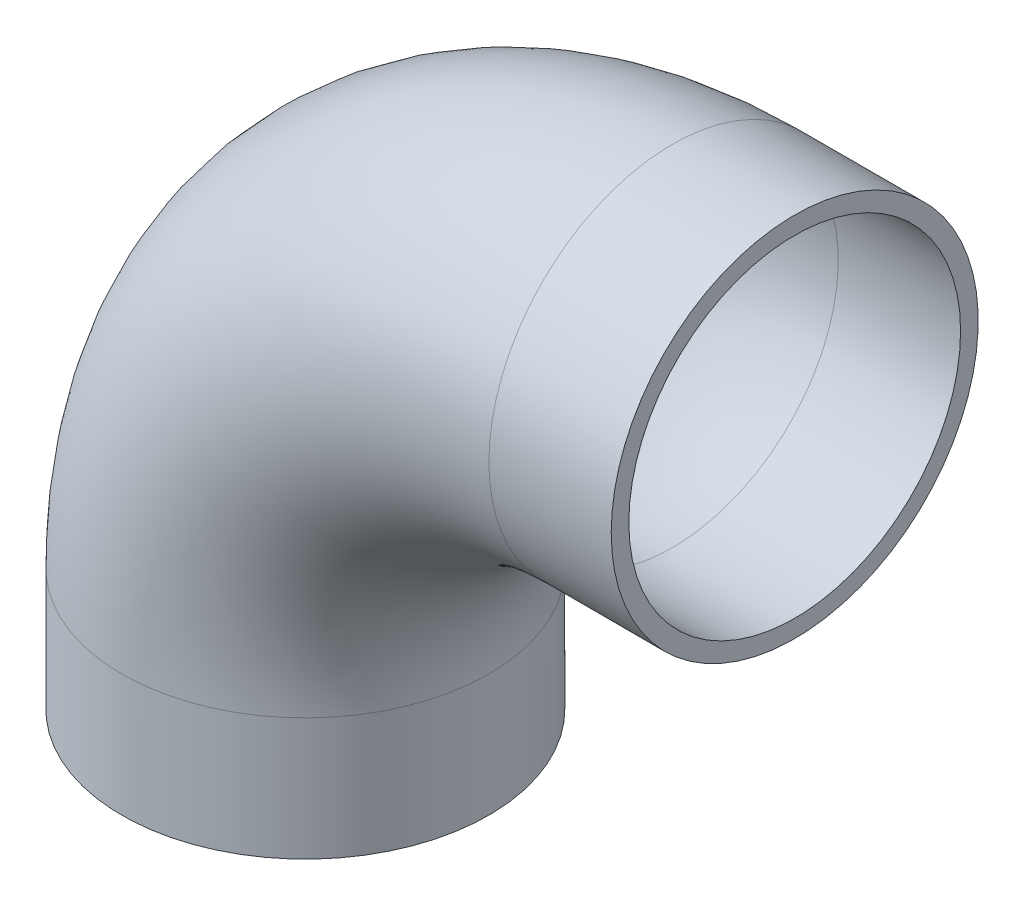
ISO-10303-21;
HEADER;
FILE_DESCRIPTION(('STEP AP214'),'2;1');
FILE_NAME('part.step','',(''),(''),'','','');
FILE_SCHEMA(('AUTOMOTIVE_DESIGN { 1 0 10303 214 1 1 1 1 }'));
ENDSEC;
DATA;
#1=APPLICATION_CONTEXT('core data for automotive mechanical design processes');
#2=APPLICATION_PROTOCOL_DEFINITION('international standard','automotive_design',2000,#1);
#3=PRODUCT_CONTEXT('',#1,'mechanical');
#4=PRODUCT('Part','Part','',(#3));
#5=PRODUCT_RELATED_PRODUCT_CATEGORY('part','',(#4));
#6=PRODUCT_DEFINITION_FORMATION('','',#4);
#7=PRODUCT_DEFINITION_CONTEXT('part definition',#1,'design');
#8=PRODUCT_DEFINITION('design','',#6,#7);
#9=PRODUCT_DEFINITION_SHAPE('','',#8);
#10=(LENGTH_UNIT() NAMED_UNIT(*) SI_UNIT(.MILLI.,.METRE.));
#11=(NAMED_UNIT(*) PLANE_ANGLE_UNIT() SI_UNIT($,.RADIAN.));
#12=(NAMED_UNIT(*) SI_UNIT($,.STERADIAN.) SOLID_ANGLE_UNIT());
#13=UNCERTAINTY_MEASURE_WITH_UNIT(LENGTH_MEASURE(1.E-05),#10,'distance_accuracy_value','');
#14=(GEOMETRIC_REPRESENTATION_CONTEXT(3) GLOBAL_UNCERTAINTY_ASSIGNED_CONTEXT((#13)) GLOBAL_UNIT_ASSIGNED_CONTEXT((#10,
#11,#12)) REPRESENTATION_CONTEXT('',''));
#15=CARTESIAN_POINT('',(0.,0.,0.));
#16=DIRECTION('',(0.,0.,1.));
#17=DIRECTION('',(1.,0.,0.));
#18=AXIS2_PLACEMENT_3D('',#15,#16,#17);
#19=CARTESIAN_POINT('',(75.,25.,0.));
#20=DIRECTION('',(0.,0.,1.));
#21=DIRECTION('',(1.,0.,0.));
#22=AXIS2_PLACEMENT_3D('',#19,#20,#21);
#23=TOROIDAL_SURFACE('',#22,75.,33.9);
#24=CARTESIAN_POINT('',(75.,100.,0.));
#25=DIRECTION('',(-1.,0.,0.));
#26=DIRECTION('',(0.,1.,0.));
#27=AXIS2_PLACEMENT_3D('',#24,#25,#26);
#28=CIRCLE('',#27,33.9);
#29=CARTESIAN_POINT('',(75.,133.9,0.));
#30=VERTEX_POINT('',#29);
#31=EDGE_CURVE('E33',#30,#30,#28,.T.);
#32=ORIENTED_EDGE('',*,*,#31,.F.);
#33=EDGE_LOOP('',(#32));
#34=FACE_BOUND('',#33,.T.);
#35=CARTESIAN_POINT('',(0.,25.,0.));
#36=DIRECTION('',(0.,-1.,0.));
#37=DIRECTION('',(-1.,0.,0.));
#38=AXIS2_PLACEMENT_3D('',#35,#36,#37);
#39=CIRCLE('',#38,33.9);
#40=CARTESIAN_POINT('',(-33.9,25.,0.));
#41=VERTEX_POINT('',#40);
#42=EDGE_CURVE('E31',#41,#41,#39,.F.);
#43=ORIENTED_EDGE('',*,*,#42,.F.);
#44=EDGE_LOOP('',(#43));
#45=FACE_BOUND('',#44,.T.);
#46=ADVANCED_FACE('F13',(#34,#45),#23,.F.);
#47=CARTESIAN_POINT('',(100.,100.,0.));
#48=DIRECTION('',(-1.,0.,0.));
#49=DIRECTION('',(0.,0.,1.));
#50=AXIS2_PLACEMENT_3D('',#47,#48,#49);
#51=CYLINDRICAL_SURFACE('',#50,33.9);
#52=CARTESIAN_POINT('',(100.,100.,0.));
#53=DIRECTION('',(-1.,0.,0.));
#54=DIRECTION('',(0.,0.,1.));
#55=AXIS2_PLACEMENT_3D('',#52,#53,#54);
#56=CIRCLE('',#55,33.9);
#57=CARTESIAN_POINT('',(100.,100.,33.9));
#58=VERTEX_POINT('',#57);
#59=EDGE_CURVE('E17',#58,#58,#56,.T.);
#60=ORIENTED_EDGE('',*,*,#59,.F.);
#61=EDGE_LOOP('',(#60));
#62=FACE_BOUND('',#61,.T.);
#63=ORIENTED_EDGE('',*,*,#31,.T.);
#64=EDGE_LOOP('',(#63));
#65=FACE_BOUND('',#64,.T.);
#66=ADVANCED_FACE('F52',(#62,#65),#51,.F.);
#67=CARTESIAN_POINT('',(0.,25.,0.));
#68=DIRECTION('',(0.,-1.,0.));
#69=DIRECTION('',(0.,0.,-1.));
#70=AXIS2_PLACEMENT_3D('',#67,#68,#69);
#71=CYLINDRICAL_SURFACE('',#70,33.9);
#72=ORIENTED_EDGE('',*,*,#42,.T.);
#73=EDGE_LOOP('',(#72));
#74=FACE_BOUND('',#73,.T.);
#75=CARTESIAN_POINT('',(0.,0.,0.));
#76=DIRECTION('',(0.,-1.,0.));
#77=DIRECTION('',(0.,0.,-1.));
#78=AXIS2_PLACEMENT_3D('',#75,#76,#77);
#79=CIRCLE('',#78,33.9);
#80=CARTESIAN_POINT('',(0.,0.,-33.9));
#81=VERTEX_POINT('',#80);
#82=EDGE_CURVE('E42',#81,#81,#79,.F.);
#83=ORIENTED_EDGE('',*,*,#82,.F.);
#84=EDGE_LOOP('',(#83));
#85=FACE_BOUND('',#84,.T.);
#86=ADVANCED_FACE('F55',(#74,#85),#71,.F.);
#87=CARTESIAN_POINT('',(100.,137.5,37.9500021082342));
#88=DIRECTION('',(1.,0.,0.));
#89=DIRECTION('',(0.,-1.,0.));
#90=AXIS2_PLACEMENT_3D('',#87,#88,#89);
#91=PLANE('',#90);
#92=ORIENTED_EDGE('',*,*,#59,.T.);
#93=EDGE_LOOP('',(#92));
#94=FACE_BOUND('',#93,.T.);
#95=CARTESIAN_POINT('',(100.,100.,0.));
#96=DIRECTION('',(-1.,0.,0.));
#97=DIRECTION('',(0.,0.,1.));
#98=AXIS2_PLACEMENT_3D('',#95,#96,#97);
#99=CIRCLE('',#98,37.5);
#100=CARTESIAN_POINT('',(100.,100.,37.5));
#101=VERTEX_POINT('',#100);
#102=EDGE_CURVE('E40',#101,#101,#99,.T.);
#103=ORIENTED_EDGE('',*,*,#102,.F.);
#104=EDGE_LOOP('',(#103));
#105=FACE_BOUND('',#104,.T.);
#106=ADVANCED_FACE('F49',(#94,#105),#91,.T.);
#107=CARTESIAN_POINT('',(37.5,0.,37.9500021083576));
#108=DIRECTION('',(0.,-1.,0.));
#109=DIRECTION('',(-1.,0.,0.));
#110=AXIS2_PLACEMENT_3D('',#107,#108,#109);
#111=PLANE('',#110);
#112=ORIENTED_EDGE('',*,*,#82,.T.);
#113=EDGE_LOOP('',(#112));
#114=FACE_BOUND('',#113,.T.);
#115=CARTESIAN_POINT('',(0.,0.,0.));
#116=DIRECTION('',(0.,-1.,0.));
#117=DIRECTION('',(0.,0.,-1.));
#118=AXIS2_PLACEMENT_3D('',#115,#116,#117);
#119=CIRCLE('',#118,37.5);
#120=CARTESIAN_POINT('',(0.,0.,-37.5));
#121=VERTEX_POINT('',#120);
#122=EDGE_CURVE('E26',#121,#121,#119,.F.);
#123=ORIENTED_EDGE('',*,*,#122,.F.);
#124=EDGE_LOOP('',(#123));
#125=FACE_BOUND('',#124,.T.);
#126=ADVANCED_FACE('F69',(#114,#125),#111,.T.);
#127=CARTESIAN_POINT('',(75.,100.,0.));
#128=DIRECTION('',(-1.,0.,0.));
#129=DIRECTION('',(0.,0.,1.));
#130=AXIS2_PLACEMENT_3D('',#127,#128,#129);
#131=CYLINDRICAL_SURFACE('',#130,37.5);
#132=ORIENTED_EDGE('',*,*,#102,.T.);
#133=EDGE_LOOP('',(#132));
#134=FACE_BOUND('',#133,.T.);
#135=CARTESIAN_POINT('',(75.,100.,0.));
#136=DIRECTION('',(-1.,0.,0.));
#137=DIRECTION('',(0.,-1.,0.));
#138=AXIS2_PLACEMENT_3D('',#135,#136,#137);
#139=CIRCLE('',#138,37.5);
#140=CARTESIAN_POINT('',(75.,62.5,0.));
#141=VERTEX_POINT('',#140);
#142=EDGE_CURVE('E21',#141,#141,#139,.T.);
#143=ORIENTED_EDGE('',*,*,#142,.F.);
#144=EDGE_LOOP('',(#143));
#145=FACE_BOUND('',#144,.T.);
#146=ADVANCED_FACE('F79',(#134,#145),#131,.T.);
#147=CARTESIAN_POINT('',(0.,0.,0.));
#148=DIRECTION('',(0.,-1.,0.));
#149=DIRECTION('',(0.,0.,-1.));
#150=AXIS2_PLACEMENT_3D('',#147,#148,#149);
#151=CYLINDRICAL_SURFACE('',#150,37.5);
#152=CARTESIAN_POINT('',(0.,25.,0.));
#153=DIRECTION('',(0.,-1.,0.));
#154=DIRECTION('',(1.,0.,0.));
#155=AXIS2_PLACEMENT_3D('',#152,#153,#154);
#156=CIRCLE('',#155,37.5);
#157=CARTESIAN_POINT('',(37.5,25.,0.));
#158=VERTEX_POINT('',#157);
#159=EDGE_CURVE('E8',#158,#158,#156,.F.);
#160=ORIENTED_EDGE('',*,*,#159,.F.);
#161=EDGE_LOOP('',(#160));
#162=FACE_BOUND('',#161,.T.);
#163=ORIENTED_EDGE('',*,*,#122,.T.);
#164=EDGE_LOOP('',(#163));
#165=FACE_BOUND('',#164,.T.);
#166=ADVANCED_FACE('F73',(#162,#165),#151,.T.);
#167=CARTESIAN_POINT('',(75.,25.,0.));
#168=DIRECTION('',(0.,0.,1.));
#169=DIRECTION('',(1.,0.,0.));
#170=AXIS2_PLACEMENT_3D('',#167,#168,#169);
#171=TOROIDAL_SURFACE('',#170,75.,37.5);
#172=ORIENTED_EDGE('',*,*,#142,.T.);
#173=EDGE_LOOP('',(#172));
#174=FACE_BOUND('',#173,.T.);
#175=ORIENTED_EDGE('',*,*,#159,.T.);
#176=EDGE_LOOP('',(#175));
#177=FACE_BOUND('',#176,.T.);
#178=ADVANCED_FACE('F71',(#174,#177),#171,.T.);
#179=CLOSED_SHELL('',(#46,#66,#86,#106,#126,#146,#166,#178));
#180=MANIFOLD_SOLID_BREP('B1',#179);
#181=ADVANCED_BREP_SHAPE_REPRESENTATION('',(#18,#180),#14);
#182=SHAPE_DEFINITION_REPRESENTATION(#9,#181);
ENDSEC;
END-ISO-10303-21;
